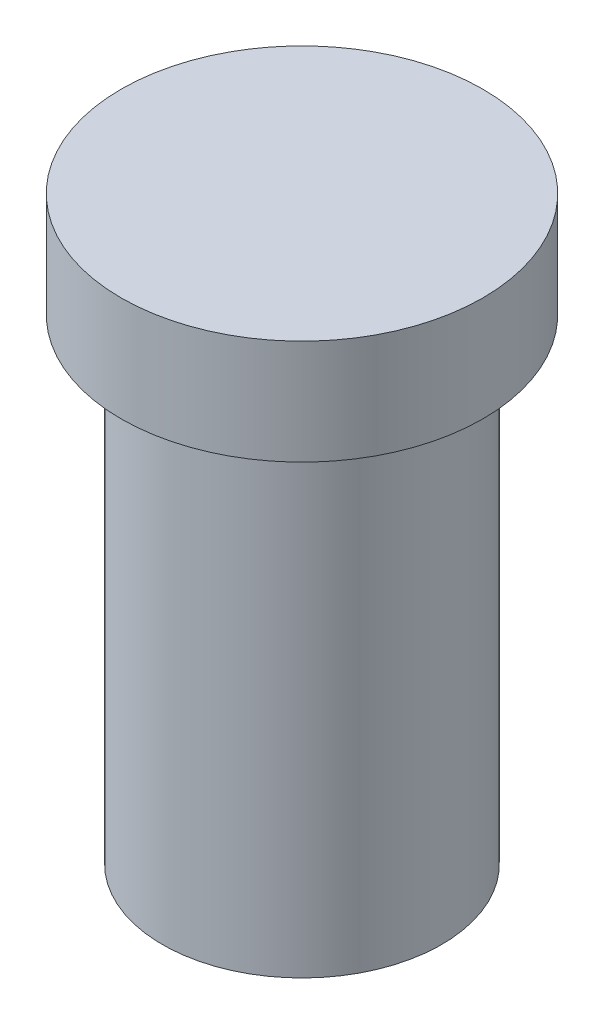
ISO-10303-21;
HEADER;
FILE_DESCRIPTION(('STEP AP214'),'2;1');
FILE_NAME('part.step','',(''),(''),'','','');
FILE_SCHEMA(('AUTOMOTIVE_DESIGN { 1 0 10303 214 1 1 1 1 }'));
ENDSEC;
DATA;
#1=APPLICATION_CONTEXT('core data for automotive mechanical design processes');
#2=APPLICATION_PROTOCOL_DEFINITION('international standard','automotive_design',2000,#1);
#3=PRODUCT_CONTEXT('',#1,'mechanical');
#4=PRODUCT('Part','Part','',(#3));
#5=PRODUCT_RELATED_PRODUCT_CATEGORY('part','',(#4));
#6=PRODUCT_DEFINITION_FORMATION('','',#4);
#7=PRODUCT_DEFINITION_CONTEXT('part definition',#1,'design');
#8=PRODUCT_DEFINITION('design','',#6,#7);
#9=PRODUCT_DEFINITION_SHAPE('','',#8);
#10=(LENGTH_UNIT() NAMED_UNIT(*) SI_UNIT(.MILLI.,.METRE.));
#11=(NAMED_UNIT(*) PLANE_ANGLE_UNIT() SI_UNIT($,.RADIAN.));
#12=(NAMED_UNIT(*) SI_UNIT($,.STERADIAN.) SOLID_ANGLE_UNIT());
#13=UNCERTAINTY_MEASURE_WITH_UNIT(LENGTH_MEASURE(1.E-05),#10,'distance_accuracy_value','');
#14=(GEOMETRIC_REPRESENTATION_CONTEXT(3) GLOBAL_UNCERTAINTY_ASSIGNED_CONTEXT((#13)) GLOBAL_UNIT_ASSIGNED_CONTEXT((#10,
#11,#12)) REPRESENTATION_CONTEXT('',''));
#15=CARTESIAN_POINT('',(0.,0.,0.));
#16=DIRECTION('',(0.,0.,1.));
#17=DIRECTION('',(1.,0.,0.));
#18=AXIS2_PLACEMENT_3D('',#15,#16,#17);
#19=CARTESIAN_POINT('',(0.,0.,0.));
#20=DIRECTION('',(0.,-1.,0.));
#21=DIRECTION('',(0.,0.,-1.));
#22=AXIS2_PLACEMENT_3D('',#19,#20,#21);
#23=PLANE('',#22);
#24=CARTESIAN_POINT('',(0.,0.,0.));
#25=DIRECTION('',(0.,-1.,0.));
#26=DIRECTION('',(0.,0.,-1.));
#27=AXIS2_PLACEMENT_3D('',#24,#25,#26);
#28=CIRCLE('',#27,22.);
#29=CARTESIAN_POINT('',(0.,0.,-22.));
#30=VERTEX_POINT('',#29);
#31=EDGE_CURVE('E42',#30,#30,#28,.T.);
#32=ORIENTED_EDGE('',*,*,#31,.T.);
#33=EDGE_LOOP('',(#32));
#34=FACE_BOUND('',#33,.T.);
#35=ADVANCED_FACE('F31',(#34),#23,.T.);
#36=CARTESIAN_POINT('',(0.,0.,0.));
#37=DIRECTION('',(0.,-1.,0.));
#38=DIRECTION('',(0.,0.,-1.));
#39=AXIS2_PLACEMENT_3D('',#36,#37,#38);
#40=CYLINDRICAL_SURFACE('',#39,22.);
#41=CARTESIAN_POINT('',(0.,72.,0.));
#42=DIRECTION('',(0.,-1.,0.));
#43=DIRECTION('',(0.,0.,-1.));
#44=AXIS2_PLACEMENT_3D('',#41,#42,#43);
#45=CIRCLE('',#44,22.);
#46=CARTESIAN_POINT('',(0.,72.,-22.));
#47=VERTEX_POINT('',#46);
#48=EDGE_CURVE('E38',#47,#47,#45,.T.);
#49=ORIENTED_EDGE('',*,*,#48,.T.);
#50=EDGE_LOOP('',(#49));
#51=FACE_BOUND('',#50,.T.);
#52=ORIENTED_EDGE('',*,*,#31,.F.);
#53=EDGE_LOOP('',(#52));
#54=FACE_BOUND('',#53,.T.);
#55=ADVANCED_FACE('F69',(#51,#54),#40,.T.);
#56=CARTESIAN_POINT('',(22.,75.,0.));
#57=DIRECTION('',(0.,-1.,0.));
#58=DIRECTION('',(0.,0.,-1.));
#59=AXIS2_PLACEMENT_3D('',#56,#57,#58);
#60=PLANE('',#59);
#61=CARTESIAN_POINT('',(0.,75.,0.));
#62=DIRECTION('',(0.,-1.,0.));
#63=DIRECTION('',(0.,0.,-1.));
#64=AXIS2_PLACEMENT_3D('',#61,#62,#63);
#65=CIRCLE('',#64,25.);
#66=CARTESIAN_POINT('',(0.,75.,-25.));
#67=VERTEX_POINT('',#66);
#68=EDGE_CURVE('E10',#67,#67,#65,.F.);
#69=ORIENTED_EDGE('',*,*,#68,.T.);
#70=EDGE_LOOP('',(#69));
#71=FACE_BOUND('',#70,.T.);
#72=CARTESIAN_POINT('',(0.,75.,0.));
#73=DIRECTION('',(0.,-1.,0.));
#74=DIRECTION('',(0.,0.,-1.));
#75=AXIS2_PLACEMENT_3D('',#72,#73,#74);
#76=CIRCLE('',#75,28.5);
#77=CARTESIAN_POINT('',(0.,75.,-28.5));
#78=VERTEX_POINT('',#77);
#79=EDGE_CURVE('E46',#78,#78,#76,.T.);
#80=ORIENTED_EDGE('',*,*,#79,.T.);
#81=EDGE_LOOP('',(#80));
#82=FACE_BOUND('',#81,.T.);
#83=ADVANCED_FACE('F66',(#71,#82),#60,.T.);
#84=CARTESIAN_POINT('',(0.,0.,0.));
#85=DIRECTION('',(0.,-1.,0.));
#86=DIRECTION('',(0.,0.,-1.));
#87=AXIS2_PLACEMENT_3D('',#84,#85,#86);
#88=CYLINDRICAL_SURFACE('',#87,28.5);
#89=CARTESIAN_POINT('',(0.,91.5109137055838,0.));
#90=DIRECTION('',(0.,-1.,0.));
#91=DIRECTION('',(0.,0.,-1.));
#92=AXIS2_PLACEMENT_3D('',#89,#90,#91);
#93=CIRCLE('',#92,28.5);
#94=CARTESIAN_POINT('',(0.,91.5109137055838,-28.5));
#95=VERTEX_POINT('',#94);
#96=EDGE_CURVE('E51',#95,#95,#93,.T.);
#97=ORIENTED_EDGE('',*,*,#96,.T.);
#98=EDGE_LOOP('',(#97));
#99=FACE_BOUND('',#98,.T.);
#100=ORIENTED_EDGE('',*,*,#79,.F.);
#101=EDGE_LOOP('',(#100));
#102=FACE_BOUND('',#101,.T.);
#103=ADVANCED_FACE('F55',(#99,#102),#88,.T.);
#104=CARTESIAN_POINT('',(28.5,91.5109137055838,0.));
#105=DIRECTION('',(0.,1.,0.));
#106=DIRECTION('',(0.,0.,1.));
#107=AXIS2_PLACEMENT_3D('',#104,#105,#106);
#108=PLANE('',#107);
#109=ORIENTED_EDGE('',*,*,#96,.F.);
#110=EDGE_LOOP('',(#109));
#111=FACE_BOUND('',#110,.T.);
#112=ADVANCED_FACE('F58',(#111),#108,.T.);
#113=CARTESIAN_POINT('',(0.,72.,0.));
#114=DIRECTION('',(0.,-1.,0.));
#115=DIRECTION('',(0.,0.,-1.));
#116=AXIS2_PLACEMENT_3D('',#113,#114,#115);
#117=TOROIDAL_SURFACE('',#116,25.,3.);
#118=ORIENTED_EDGE('',*,*,#68,.F.);
#119=EDGE_LOOP('',(#118));
#120=FACE_BOUND('',#119,.T.);
#121=ORIENTED_EDGE('',*,*,#48,.F.);
#122=EDGE_LOOP('',(#121));
#123=FACE_BOUND('',#122,.T.);
#124=ADVANCED_FACE('F33',(#120,#123),#117,.F.);
#125=CLOSED_SHELL('',(#35,#55,#83,#103,#112,#124));
#126=MANIFOLD_SOLID_BREP('B2',#125);
#127=ADVANCED_BREP_SHAPE_REPRESENTATION('',(#18,#126),#14);
#128=SHAPE_DEFINITION_REPRESENTATION(#9,#127);
ENDSEC;
END-ISO-10303-21;
